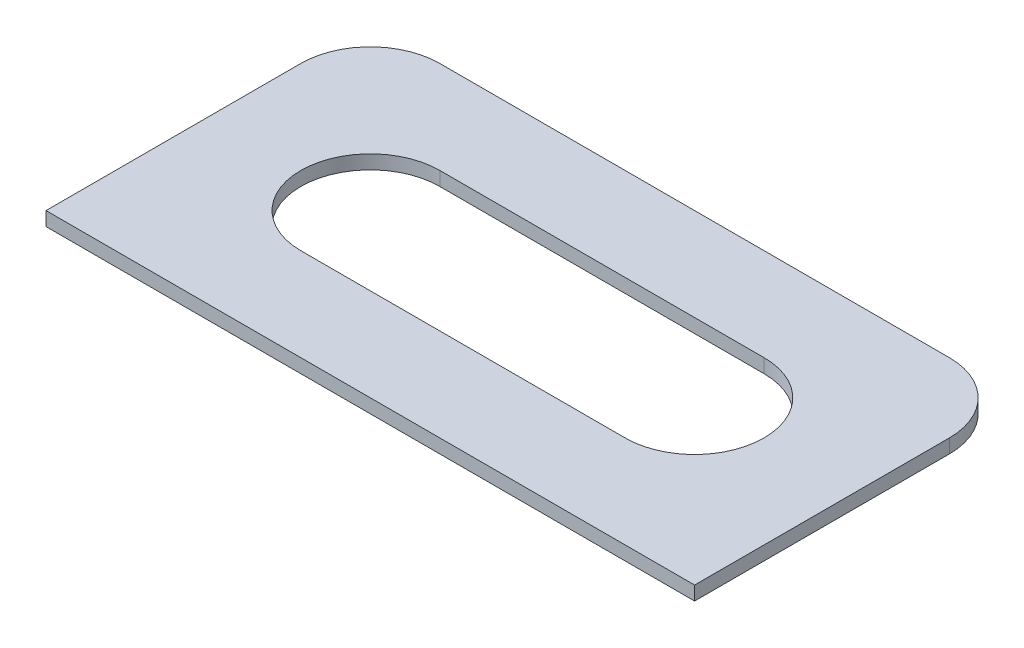
ISO-10303-21;
HEADER;
FILE_DESCRIPTION(('STEP AP214'),'2;1');
FILE_NAME('part.step','',(''),(''),'','','');
FILE_SCHEMA(('AUTOMOTIVE_DESIGN { 1 0 10303 214 1 1 1 1 }'));
ENDSEC;
DATA;
#1=APPLICATION_CONTEXT('core data for automotive mechanical design processes');
#2=APPLICATION_PROTOCOL_DEFINITION('international standard','automotive_design',2000,#1);
#3=PRODUCT_CONTEXT('',#1,'mechanical');
#4=PRODUCT('Part','Part','',(#3));
#5=PRODUCT_RELATED_PRODUCT_CATEGORY('part','',(#4));
#6=PRODUCT_DEFINITION_FORMATION('','',#4);
#7=PRODUCT_DEFINITION_CONTEXT('part definition',#1,'design');
#8=PRODUCT_DEFINITION('design','',#6,#7);
#9=PRODUCT_DEFINITION_SHAPE('','',#8);
#10=(LENGTH_UNIT() NAMED_UNIT(*) SI_UNIT(.MILLI.,.METRE.));
#11=(NAMED_UNIT(*) PLANE_ANGLE_UNIT() SI_UNIT($,.RADIAN.));
#12=(NAMED_UNIT(*) SI_UNIT($,.STERADIAN.) SOLID_ANGLE_UNIT());
#13=UNCERTAINTY_MEASURE_WITH_UNIT(LENGTH_MEASURE(1.E-05),#10,'distance_accuracy_value','');
#14=(GEOMETRIC_REPRESENTATION_CONTEXT(3) GLOBAL_UNCERTAINTY_ASSIGNED_CONTEXT((#13)) GLOBAL_UNIT_ASSIGNED_CONTEXT((#10,
#11,#12)) REPRESENTATION_CONTEXT('',''));
#15=CARTESIAN_POINT('',(0.,0.,0.));
#16=DIRECTION('',(0.,0.,1.));
#17=DIRECTION('',(1.,0.,0.));
#18=AXIS2_PLACEMENT_3D('',#15,#16,#17);
#19=CARTESIAN_POINT('',(-65.,3.,-6.65202313433344));
#20=DIRECTION('',(0.,1.,0.));
#21=DIRECTION('',(0.,0.,1.));
#22=AXIS2_PLACEMENT_3D('',#19,#20,#21);
#23=PLANE('',#22);
#24=DIRECTION('',(0.,0.,-1.));
#25=VECTOR('',#24,1.);
#26=CARTESIAN_POINT('',(60.,3.,-6.65202313433344));
#27=LINE('',#26,#25);
#28=CARTESIAN_POINT('',(60.,3.,48.3479768656666));
#29=VERTEX_POINT('',#28);
#30=CARTESIAN_POINT('',(60.,3.,-6.65202313433344));
#31=VERTEX_POINT('',#30);
#32=EDGE_CURVE('E146',#29,#31,#27,.T.);
#33=ORIENTED_EDGE('',*,*,#32,.T.);
#34=CARTESIAN_POINT('',(45.,3.,-6.65202313433344));
#35=DIRECTION('',(0.,1.,0.));
#36=DIRECTION('',(0.,0.,-1.));
#37=AXIS2_PLACEMENT_3D('',#34,#35,#36);
#38=CIRCLE('',#37,15.);
#39=CARTESIAN_POINT('',(45.,3.,-21.6520231343334));
#40=VERTEX_POINT('',#39);
#41=EDGE_CURVE('E149',#31,#40,#38,.T.);
#42=ORIENTED_EDGE('',*,*,#41,.T.);
#43=DIRECTION('',(-1.,0.,0.));
#44=VECTOR('',#43,1.);
#45=CARTESIAN_POINT('',(-65.,3.,-21.6520231343334));
#46=LINE('',#45,#44);
#47=CARTESIAN_POINT('',(-65.,3.,-21.6520231343334));
#48=VERTEX_POINT('',#47);
#49=EDGE_CURVE('E152',#40,#48,#46,.T.);
#50=ORIENTED_EDGE('',*,*,#49,.T.);
#51=CARTESIAN_POINT('',(-65.,3.,-6.65202313433344));
#52=DIRECTION('',(0.,1.,0.));
#53=DIRECTION('',(0.,0.,1.));
#54=AXIS2_PLACEMENT_3D('',#51,#52,#53);
#55=CIRCLE('',#54,15.);
#56=CARTESIAN_POINT('',(-80.,3.,-6.65202313433344));
#57=VERTEX_POINT('',#56);
#58=EDGE_CURVE('E154',#48,#57,#55,.T.);
#59=ORIENTED_EDGE('',*,*,#58,.T.);
#60=DIRECTION('',(0.,0.,1.));
#61=VECTOR('',#60,1.);
#62=CARTESIAN_POINT('',(-80.,3.,-6.65202313433344));
#63=LINE('',#62,#61);
#64=CARTESIAN_POINT('',(-80.,3.,48.3479768656666));
#65=VERTEX_POINT('',#64);
#66=EDGE_CURVE('E156',#57,#65,#63,.T.);
#67=ORIENTED_EDGE('',*,*,#66,.T.);
#68=DIRECTION('',(1.,0.,0.));
#69=VECTOR('',#68,1.);
#70=CARTESIAN_POINT('',(-80.,3.,48.3479768656666));
#71=LINE('',#70,#69);
#72=EDGE_CURVE('E158',#65,#29,#71,.T.);
#73=ORIENTED_EDGE('',*,*,#72,.T.);
#74=EDGE_LOOP('',(#33,#42,#50,#59,#67,#73));
#75=FACE_BOUND('',#74,.T.);
#76=DIRECTION('',(1.,0.,0.));
#77=VECTOR('',#76,1.);
#78=CARTESIAN_POINT('',(-45.,3.,28.3479768656665));
#79=LINE('',#78,#77);
#80=CARTESIAN_POINT('',(-45.,3.,28.3479768656665));
#81=VERTEX_POINT('',#80);
#82=CARTESIAN_POINT('',(25.,3.,28.3479768656665));
#83=VERTEX_POINT('',#82);
#84=EDGE_CURVE('E118',#81,#83,#79,.T.);
#85=ORIENTED_EDGE('',*,*,#84,.F.);
#86=CARTESIAN_POINT('',(-45.,3.,13.3479768656665));
#87=DIRECTION('',(0.,1.,0.));
#88=DIRECTION('',(0.,0.,1.));
#89=AXIS2_PLACEMENT_3D('',#86,#87,#88);
#90=CIRCLE('',#89,15.);
#91=CARTESIAN_POINT('',(-45.,3.,-1.65202313433345));
#92=VERTEX_POINT('',#91);
#93=EDGE_CURVE('E110',#92,#81,#90,.T.);
#94=ORIENTED_EDGE('',*,*,#93,.F.);
#95=DIRECTION('',(-1.,0.,0.));
#96=VECTOR('',#95,1.);
#97=CARTESIAN_POINT('',(-45.,3.,-1.65202313433345));
#98=LINE('',#97,#96);
#99=CARTESIAN_POINT('',(25.,3.,-1.65202313433346));
#100=VERTEX_POINT('',#99);
#101=EDGE_CURVE('E132',#100,#92,#98,.T.);
#102=ORIENTED_EDGE('',*,*,#101,.F.);
#103=CARTESIAN_POINT('',(25.,3.,13.3479768656665));
#104=DIRECTION('',(0.,1.,0.));
#105=DIRECTION('',(0.,0.,1.));
#106=AXIS2_PLACEMENT_3D('',#103,#104,#105);
#107=CIRCLE('',#106,15.);
#108=EDGE_CURVE('E130',#83,#100,#107,.T.);
#109=ORIENTED_EDGE('',*,*,#108,.F.);
#110=EDGE_LOOP('',(#85,#94,#102,#109));
#111=FACE_BOUND('',#110,.T.);
#112=ADVANCED_FACE('F33',(#75,#111),#23,.T.);
#113=CARTESIAN_POINT('',(-65.,0.,-6.65202313433344));
#114=DIRECTION('',(0.,1.,0.));
#115=DIRECTION('',(0.,0.,1.));
#116=AXIS2_PLACEMENT_3D('',#113,#114,#115);
#117=PLANE('',#116);
#118=DIRECTION('',(0.,0.,-1.));
#119=VECTOR('',#118,1.);
#120=CARTESIAN_POINT('',(60.,0.,-6.65202313433344));
#121=LINE('',#120,#119);
#122=CARTESIAN_POINT('',(60.,0.,48.3479768656666));
#123=VERTEX_POINT('',#122);
#124=CARTESIAN_POINT('',(60.,0.,-6.65202313433344));
#125=VERTEX_POINT('',#124);
#126=EDGE_CURVE('E126',#123,#125,#121,.T.);
#127=ORIENTED_EDGE('',*,*,#126,.F.);
#128=DIRECTION('',(1.,0.,0.));
#129=VECTOR('',#128,1.);
#130=CARTESIAN_POINT('',(-80.,0.,48.3479768656666));
#131=LINE('',#130,#129);
#132=CARTESIAN_POINT('',(-80.,0.,48.3479768656666));
#133=VERTEX_POINT('',#132);
#134=EDGE_CURVE('E150',#133,#123,#131,.T.);
#135=ORIENTED_EDGE('',*,*,#134,.F.);
#136=DIRECTION('',(0.,0.,1.));
#137=VECTOR('',#136,1.);
#138=CARTESIAN_POINT('',(-80.,0.,-6.65202313433344));
#139=LINE('',#138,#137);
#140=CARTESIAN_POINT('',(-80.,0.,-6.65202313433344));
#141=VERTEX_POINT('',#140);
#142=EDGE_CURVE('E169',#141,#133,#139,.T.);
#143=ORIENTED_EDGE('',*,*,#142,.F.);
#144=CARTESIAN_POINT('',(-65.,0.,-6.65202313433344));
#145=DIRECTION('',(0.,1.,0.));
#146=DIRECTION('',(0.,0.,1.));
#147=AXIS2_PLACEMENT_3D('',#144,#145,#146);
#148=CIRCLE('',#147,15.);
#149=CARTESIAN_POINT('',(-65.,0.,-21.6520231343334));
#150=VERTEX_POINT('',#149);
#151=EDGE_CURVE('E167',#150,#141,#148,.T.);
#152=ORIENTED_EDGE('',*,*,#151,.F.);
#153=DIRECTION('',(-1.,0.,0.));
#154=VECTOR('',#153,1.);
#155=CARTESIAN_POINT('',(-65.,0.,-21.6520231343334));
#156=LINE('',#155,#154);
#157=CARTESIAN_POINT('',(45.,0.,-21.6520231343334));
#158=VERTEX_POINT('',#157);
#159=EDGE_CURVE('E165',#158,#150,#156,.T.);
#160=ORIENTED_EDGE('',*,*,#159,.F.);
#161=CARTESIAN_POINT('',(45.,0.,-6.65202313433344));
#162=DIRECTION('',(0.,1.,0.));
#163=DIRECTION('',(0.,0.,-1.));
#164=AXIS2_PLACEMENT_3D('',#161,#162,#163);
#165=CIRCLE('',#164,15.);
#166=EDGE_CURVE('E163',#125,#158,#165,.T.);
#167=ORIENTED_EDGE('',*,*,#166,.F.);
#168=EDGE_LOOP('',(#127,#135,#143,#152,#160,#167));
#169=FACE_BOUND('',#168,.T.);
#170=CARTESIAN_POINT('',(-45.,0.,13.3479768656665));
#171=DIRECTION('',(0.,1.,0.));
#172=DIRECTION('',(0.,0.,1.));
#173=AXIS2_PLACEMENT_3D('',#170,#171,#172);
#174=CIRCLE('',#173,15.);
#175=CARTESIAN_POINT('',(-45.,0.,-1.65202313433345));
#176=VERTEX_POINT('',#175);
#177=CARTESIAN_POINT('',(-45.,0.,28.3479768656665));
#178=VERTEX_POINT('',#177);
#179=EDGE_CURVE('E56',#176,#178,#174,.T.);
#180=ORIENTED_EDGE('',*,*,#179,.T.);
#181=DIRECTION('',(1.,0.,0.));
#182=VECTOR('',#181,1.);
#183=CARTESIAN_POINT('',(-45.,0.,28.3479768656665));
#184=LINE('',#183,#182);
#185=CARTESIAN_POINT('',(25.,0.,28.3479768656665));
#186=VERTEX_POINT('',#185);
#187=EDGE_CURVE('E125',#178,#186,#184,.T.);
#188=ORIENTED_EDGE('',*,*,#187,.T.);
#189=CARTESIAN_POINT('',(25.,0.,13.3479768656665));
#190=DIRECTION('',(0.,1.,0.));
#191=DIRECTION('',(0.,0.,1.));
#192=AXIS2_PLACEMENT_3D('',#189,#190,#191);
#193=CIRCLE('',#192,15.);
#194=CARTESIAN_POINT('',(25.,0.,-1.65202313433346));
#195=VERTEX_POINT('',#194);
#196=EDGE_CURVE('E138',#186,#195,#193,.T.);
#197=ORIENTED_EDGE('',*,*,#196,.T.);
#198=DIRECTION('',(-1.,0.,0.));
#199=VECTOR('',#198,1.);
#200=CARTESIAN_POINT('',(-45.,0.,-1.65202313433345));
#201=LINE('',#200,#199);
#202=EDGE_CURVE('E119',#195,#176,#201,.T.);
#203=ORIENTED_EDGE('',*,*,#202,.T.);
#204=EDGE_LOOP('',(#180,#188,#197,#203));
#205=FACE_BOUND('',#204,.T.);
#206=ADVANCED_FACE('F193',(#169,#205),#117,.F.);
#207=CARTESIAN_POINT('',(60.,3.,-6.65202313433344));
#208=DIRECTION('',(-1.,0.,0.));
#209=DIRECTION('',(0.,0.,1.));
#210=AXIS2_PLACEMENT_3D('',#207,#208,#209);
#211=PLANE('',#210);
#212=ORIENTED_EDGE('',*,*,#126,.T.);
#213=DIRECTION('',(0.,-1.,0.));
#214=VECTOR('',#213,1.);
#215=CARTESIAN_POINT('',(60.,3.,-6.65202313433344));
#216=LINE('',#215,#214);
#217=EDGE_CURVE('E11',#31,#125,#216,.T.);
#218=ORIENTED_EDGE('',*,*,#217,.F.);
#219=ORIENTED_EDGE('',*,*,#32,.F.);
#220=DIRECTION('',(0.,-1.,0.));
#221=VECTOR('',#220,1.);
#222=CARTESIAN_POINT('',(60.,3.,48.3479768656666));
#223=LINE('',#222,#221);
#224=EDGE_CURVE('E160',#29,#123,#223,.T.);
#225=ORIENTED_EDGE('',*,*,#224,.T.);
#226=EDGE_LOOP('',(#212,#218,#219,#225));
#227=FACE_BOUND('',#226,.T.);
#228=ADVANCED_FACE('F35',(#227),#211,.F.);
#229=CARTESIAN_POINT('',(45.,3.,-6.65202313433344));
#230=DIRECTION('',(0.,-1.,0.));
#231=DIRECTION('',(0.,0.,-1.));
#232=AXIS2_PLACEMENT_3D('',#229,#230,#231);
#233=CYLINDRICAL_SURFACE('',#232,15.);
#234=ORIENTED_EDGE('',*,*,#166,.T.);
#235=DIRECTION('',(0.,-1.,0.));
#236=VECTOR('',#235,1.);
#237=CARTESIAN_POINT('',(45.,3.,-21.6520231343334));
#238=LINE('',#237,#236);
#239=EDGE_CURVE('E41',#40,#158,#238,.T.);
#240=ORIENTED_EDGE('',*,*,#239,.F.);
#241=ORIENTED_EDGE('',*,*,#41,.F.);
#242=ORIENTED_EDGE('',*,*,#217,.T.);
#243=EDGE_LOOP('',(#234,#240,#241,#242));
#244=FACE_BOUND('',#243,.T.);
#245=ADVANCED_FACE('F210',(#244),#233,.T.);
#246=CARTESIAN_POINT('',(-65.,3.,-21.6520231343334));
#247=DIRECTION('',(0.,0.,1.));
#248=DIRECTION('',(1.,0.,0.));
#249=AXIS2_PLACEMENT_3D('',#246,#247,#248);
#250=PLANE('',#249);
#251=ORIENTED_EDGE('',*,*,#159,.T.);
#252=DIRECTION('',(0.,-1.,0.));
#253=VECTOR('',#252,1.);
#254=CARTESIAN_POINT('',(-65.,3.,-21.6520231343334));
#255=LINE('',#254,#253);
#256=EDGE_CURVE('E180',#48,#150,#255,.T.);
#257=ORIENTED_EDGE('',*,*,#256,.F.);
#258=ORIENTED_EDGE('',*,*,#49,.F.);
#259=ORIENTED_EDGE('',*,*,#239,.T.);
#260=EDGE_LOOP('',(#251,#257,#258,#259));
#261=FACE_BOUND('',#260,.T.);
#262=ADVANCED_FACE('F187',(#261),#250,.F.);
#263=CARTESIAN_POINT('',(-65.,3.,-6.65202313433344));
#264=DIRECTION('',(0.,-1.,0.));
#265=DIRECTION('',(0.,0.,-1.));
#266=AXIS2_PLACEMENT_3D('',#263,#264,#265);
#267=CYLINDRICAL_SURFACE('',#266,15.);
#268=ORIENTED_EDGE('',*,*,#151,.T.);
#269=DIRECTION('',(0.,-1.,0.));
#270=VECTOR('',#269,1.);
#271=CARTESIAN_POINT('',(-80.,3.,-6.65202313433344));
#272=LINE('',#271,#270);
#273=EDGE_CURVE('E177',#57,#141,#272,.T.);
#274=ORIENTED_EDGE('',*,*,#273,.F.);
#275=ORIENTED_EDGE('',*,*,#58,.F.);
#276=ORIENTED_EDGE('',*,*,#256,.T.);
#277=EDGE_LOOP('',(#268,#274,#275,#276));
#278=FACE_BOUND('',#277,.T.);
#279=ADVANCED_FACE('F199',(#278),#267,.T.);
#280=CARTESIAN_POINT('',(-80.,3.,-6.65202313433344));
#281=DIRECTION('',(1.,0.,0.));
#282=DIRECTION('',(0.,0.,-1.));
#283=AXIS2_PLACEMENT_3D('',#280,#281,#282);
#284=PLANE('',#283);
#285=ORIENTED_EDGE('',*,*,#142,.T.);
#286=DIRECTION('',(0.,-1.,0.));
#287=VECTOR('',#286,1.);
#288=CARTESIAN_POINT('',(-80.,3.,48.3479768656666));
#289=LINE('',#288,#287);
#290=EDGE_CURVE('E174',#65,#133,#289,.T.);
#291=ORIENTED_EDGE('',*,*,#290,.F.);
#292=ORIENTED_EDGE('',*,*,#66,.F.);
#293=ORIENTED_EDGE('',*,*,#273,.T.);
#294=EDGE_LOOP('',(#285,#291,#292,#293));
#295=FACE_BOUND('',#294,.T.);
#296=ADVANCED_FACE('F203',(#295),#284,.F.);
#297=CARTESIAN_POINT('',(-80.,3.,48.3479768656666));
#298=DIRECTION('',(0.,0.,-1.));
#299=DIRECTION('',(-1.,0.,0.));
#300=AXIS2_PLACEMENT_3D('',#297,#298,#299);
#301=PLANE('',#300);
#302=ORIENTED_EDGE('',*,*,#134,.T.);
#303=ORIENTED_EDGE('',*,*,#224,.F.);
#304=ORIENTED_EDGE('',*,*,#72,.F.);
#305=ORIENTED_EDGE('',*,*,#290,.T.);
#306=EDGE_LOOP('',(#302,#303,#304,#305));
#307=FACE_BOUND('',#306,.T.);
#308=ADVANCED_FACE('F213',(#307),#301,.F.);
#309=CARTESIAN_POINT('',(-45.,3.,13.3479768656665));
#310=DIRECTION('',(0.,-1.,0.));
#311=DIRECTION('',(0.,0.,-1.));
#312=AXIS2_PLACEMENT_3D('',#309,#310,#311);
#313=CYLINDRICAL_SURFACE('',#312,15.);
#314=ORIENTED_EDGE('',*,*,#179,.F.);
#315=DIRECTION('',(0.,-1.,0.));
#316=VECTOR('',#315,1.);
#317=CARTESIAN_POINT('',(-45.,3.,-1.65202313433345));
#318=LINE('',#317,#316);
#319=EDGE_CURVE('E114',#92,#176,#318,.T.);
#320=ORIENTED_EDGE('',*,*,#319,.F.);
#321=ORIENTED_EDGE('',*,*,#93,.T.);
#322=DIRECTION('',(0.,-1.,0.));
#323=VECTOR('',#322,1.);
#324=CARTESIAN_POINT('',(-45.,3.,28.3479768656665));
#325=LINE('',#324,#323);
#326=EDGE_CURVE('E113',#81,#178,#325,.T.);
#327=ORIENTED_EDGE('',*,*,#326,.T.);
#328=EDGE_LOOP('',(#314,#320,#321,#327));
#329=FACE_BOUND('',#328,.T.);
#330=ADVANCED_FACE('F112',(#329),#313,.F.);
#331=CARTESIAN_POINT('',(-45.,3.,28.3479768656665));
#332=DIRECTION('',(0.,0.,-1.));
#333=DIRECTION('',(-1.,0.,0.));
#334=AXIS2_PLACEMENT_3D('',#331,#332,#333);
#335=PLANE('',#334);
#336=ORIENTED_EDGE('',*,*,#187,.F.);
#337=ORIENTED_EDGE('',*,*,#326,.F.);
#338=ORIENTED_EDGE('',*,*,#84,.T.);
#339=DIRECTION('',(0.,-1.,0.));
#340=VECTOR('',#339,1.);
#341=CARTESIAN_POINT('',(25.,3.,28.3479768656665));
#342=LINE('',#341,#340);
#343=EDGE_CURVE('E127',#83,#186,#342,.T.);
#344=ORIENTED_EDGE('',*,*,#343,.T.);
#345=EDGE_LOOP('',(#336,#337,#338,#344));
#346=FACE_BOUND('',#345,.T.);
#347=ADVANCED_FACE('F122',(#346),#335,.T.);
#348=CARTESIAN_POINT('',(25.,3.,13.3479768656665));
#349=DIRECTION('',(0.,-1.,0.));
#350=DIRECTION('',(0.,0.,-1.));
#351=AXIS2_PLACEMENT_3D('',#348,#349,#350);
#352=CYLINDRICAL_SURFACE('',#351,15.);
#353=ORIENTED_EDGE('',*,*,#196,.F.);
#354=ORIENTED_EDGE('',*,*,#343,.F.);
#355=ORIENTED_EDGE('',*,*,#108,.T.);
#356=DIRECTION('',(0.,-1.,0.));
#357=VECTOR('',#356,1.);
#358=CARTESIAN_POINT('',(25.,3.,-1.65202313433346));
#359=LINE('',#358,#357);
#360=EDGE_CURVE('E48',#100,#195,#359,.T.);
#361=ORIENTED_EDGE('',*,*,#360,.T.);
#362=EDGE_LOOP('',(#353,#354,#355,#361));
#363=FACE_BOUND('',#362,.T.);
#364=ADVANCED_FACE('F231',(#363),#352,.F.);
#365=CARTESIAN_POINT('',(-45.,3.,-1.65202313433345));
#366=DIRECTION('',(0.,0.,1.));
#367=DIRECTION('',(1.,0.,0.));
#368=AXIS2_PLACEMENT_3D('',#365,#366,#367);
#369=PLANE('',#368);
#370=ORIENTED_EDGE('',*,*,#202,.F.);
#371=ORIENTED_EDGE('',*,*,#360,.F.);
#372=ORIENTED_EDGE('',*,*,#101,.T.);
#373=ORIENTED_EDGE('',*,*,#319,.T.);
#374=EDGE_LOOP('',(#370,#371,#372,#373));
#375=FACE_BOUND('',#374,.T.);
#376=ADVANCED_FACE('F234',(#375),#369,.T.);
#377=CLOSED_SHELL('',(#112,#206,#228,#245,#262,#279,#296,#308,#330,#347,#364,#376));
#378=MANIFOLD_SOLID_BREP('B2',#377);
#379=ADVANCED_BREP_SHAPE_REPRESENTATION('',(#18,#378),#14);
#380=SHAPE_DEFINITION_REPRESENTATION(#9,#379);
ENDSEC;
END-ISO-10303-21;
